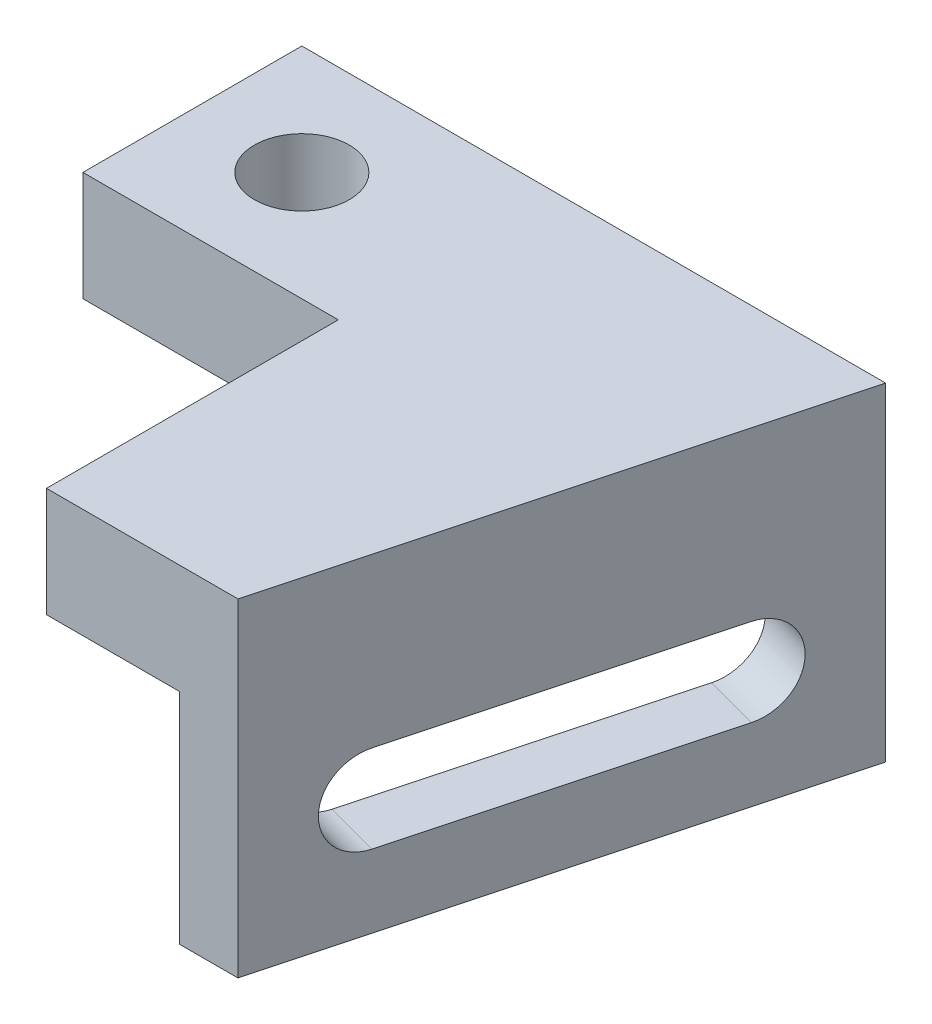
ISO-10303-21;
HEADER;
FILE_DESCRIPTION(('STEP AP214'),'2;1');
FILE_NAME('part.step','',(''),(''),'','','');
FILE_SCHEMA(('AUTOMOTIVE_DESIGN { 1 0 10303 214 1 1 1 1 }'));
ENDSEC;
DATA;
#1=APPLICATION_CONTEXT('core data for automotive mechanical design processes');
#2=APPLICATION_PROTOCOL_DEFINITION('international standard','automotive_design',2000,#1);
#3=PRODUCT_CONTEXT('',#1,'mechanical');
#4=PRODUCT('Part','Part','',(#3));
#5=PRODUCT_RELATED_PRODUCT_CATEGORY('part','',(#4));
#6=PRODUCT_DEFINITION_FORMATION('','',#4);
#7=PRODUCT_DEFINITION_CONTEXT('part definition',#1,'design');
#8=PRODUCT_DEFINITION('design','',#6,#7);
#9=PRODUCT_DEFINITION_SHAPE('','',#8);
#10=(LENGTH_UNIT() NAMED_UNIT(*) SI_UNIT(.MILLI.,.METRE.));
#11=(NAMED_UNIT(*) PLANE_ANGLE_UNIT() SI_UNIT($,.RADIAN.));
#12=(NAMED_UNIT(*) SI_UNIT($,.STERADIAN.) SOLID_ANGLE_UNIT());
#13=UNCERTAINTY_MEASURE_WITH_UNIT(LENGTH_MEASURE(1.E-05),#10,'distance_accuracy_value','');
#14=(GEOMETRIC_REPRESENTATION_CONTEXT(3) GLOBAL_UNCERTAINTY_ASSIGNED_CONTEXT((#13)) GLOBAL_UNIT_ASSIGNED_CONTEXT((#10,
#11,#12)) REPRESENTATION_CONTEXT('',''));
#15=CARTESIAN_POINT('',(0.,0.,0.));
#16=DIRECTION('',(0.,0.,1.));
#17=DIRECTION('',(1.,0.,0.));
#18=AXIS2_PLACEMENT_3D('',#15,#16,#17);
#19=CARTESIAN_POINT('',(0.,0.,0.));
#20=DIRECTION('',(0.,1.,0.));
#21=DIRECTION('',(0.,0.,1.));
#22=AXIS2_PLACEMENT_3D('',#19,#20,#21);
#23=PLANE('',#22);
#24=CARTESIAN_POINT('',(-20.,0.,-15.));
#25=DIRECTION('',(0.,1.,0.));
#26=DIRECTION('',(0.,0.,1.));
#27=AXIS2_PLACEMENT_3D('',#24,#25,#26);
#28=CIRCLE('',#27,6.5);
#29=CARTESIAN_POINT('',(-20.,0.,-8.49999999999999));
#30=VERTEX_POINT('',#29);
#31=EDGE_CURVE('E196',#30,#30,#28,.T.);
#32=ORIENTED_EDGE('',*,*,#31,.T.);
#33=EDGE_LOOP('',(#32));
#34=FACE_BOUND('',#33,.T.);
#35=DIRECTION('',(0.258819045102517,0.,-0.965925826289069));
#36=VECTOR('',#35,1.);
#37=CARTESIAN_POINT('',(18.2435565298217,0.,40.));
#38=LINE('',#37,#36);
#39=CARTESIAN_POINT('',(18.2435565298217,0.,40.));
#40=VERTEX_POINT('',#39);
#41=CARTESIAN_POINT('',(37.,0.,-30.));
#42=VERTEX_POINT('',#41);
#43=EDGE_CURVE('E166',#40,#42,#38,.T.);
#44=ORIENTED_EDGE('',*,*,#43,.F.);
#45=DIRECTION('',(1.,0.,0.));
#46=VECTOR('',#45,1.);
#47=CARTESIAN_POINT('',(26.2435565298217,0.,40.));
#48=LINE('',#47,#46);
#49=CARTESIAN_POINT('',(0.,0.,40.));
#50=VERTEX_POINT('',#49);
#51=EDGE_CURVE('E210',#50,#40,#48,.T.);
#52=ORIENTED_EDGE('',*,*,#51,.F.);
#53=DIRECTION('',(0.,0.,1.));
#54=VECTOR('',#53,1.);
#55=CARTESIAN_POINT('',(0.,0.,0.));
#56=LINE('',#55,#54);
#57=CARTESIAN_POINT('',(0.,0.,0.));
#58=VERTEX_POINT('',#57);
#59=EDGE_CURVE('E234',#58,#50,#56,.T.);
#60=ORIENTED_EDGE('',*,*,#59,.F.);
#61=DIRECTION('',(1.,0.,0.));
#62=VECTOR('',#61,1.);
#63=CARTESIAN_POINT('',(-35.,0.,0.));
#64=LINE('',#63,#62);
#65=CARTESIAN_POINT('',(-35.,0.,0.));
#66=VERTEX_POINT('',#65);
#67=EDGE_CURVE('E231',#66,#58,#64,.T.);
#68=ORIENTED_EDGE('',*,*,#67,.F.);
#69=DIRECTION('',(0.,0.,1.));
#70=VECTOR('',#69,1.);
#71=CARTESIAN_POINT('',(-35.,0.,-30.));
#72=LINE('',#71,#70);
#73=CARTESIAN_POINT('',(-35.,0.,-30.));
#74=VERTEX_POINT('',#73);
#75=EDGE_CURVE('E228',#74,#66,#72,.T.);
#76=ORIENTED_EDGE('',*,*,#75,.F.);
#77=DIRECTION('',(-1.,0.,0.));
#78=VECTOR('',#77,1.);
#79=CARTESIAN_POINT('',(45.,0.,-30.));
#80=LINE('',#79,#78);
#81=EDGE_CURVE('E201',#42,#74,#80,.T.);
#82=ORIENTED_EDGE('',*,*,#81,.F.);
#83=EDGE_LOOP('',(#44,#52,#60,#68,#76,#82));
#84=FACE_BOUND('',#83,.T.);
#85=ADVANCED_FACE('F43',(#34,#84),#23,.F.);
#86=CARTESIAN_POINT('',(0.,15.,0.));
#87=DIRECTION('',(0.,1.,0.));
#88=DIRECTION('',(0.,0.,1.));
#89=AXIS2_PLACEMENT_3D('',#86,#87,#88);
#90=PLANE('',#89);
#91=DIRECTION('',(-1.,0.,0.));
#92=VECTOR('',#91,1.);
#93=CARTESIAN_POINT('',(45.,15.,-30.));
#94=LINE('',#93,#92);
#95=CARTESIAN_POINT('',(45.,15.,-30.));
#96=VERTEX_POINT('',#95);
#97=CARTESIAN_POINT('',(-35.,15.,-30.));
#98=VERTEX_POINT('',#97);
#99=EDGE_CURVE('E205',#96,#98,#94,.T.);
#100=ORIENTED_EDGE('',*,*,#99,.T.);
#101=DIRECTION('',(0.,0.,1.));
#102=VECTOR('',#101,1.);
#103=CARTESIAN_POINT('',(-35.,15.,-30.));
#104=LINE('',#103,#102);
#105=CARTESIAN_POINT('',(-35.,15.,0.));
#106=VERTEX_POINT('',#105);
#107=EDGE_CURVE('E209',#98,#106,#104,.T.);
#108=ORIENTED_EDGE('',*,*,#107,.T.);
#109=DIRECTION('',(1.,0.,0.));
#110=VECTOR('',#109,1.);
#111=CARTESIAN_POINT('',(-35.,15.,0.));
#112=LINE('',#111,#110);
#113=CARTESIAN_POINT('',(0.,15.,0.));
#114=VERTEX_POINT('',#113);
#115=EDGE_CURVE('E213',#106,#114,#112,.T.);
#116=ORIENTED_EDGE('',*,*,#115,.T.);
#117=DIRECTION('',(0.,0.,1.));
#118=VECTOR('',#117,1.);
#119=CARTESIAN_POINT('',(0.,15.,0.));
#120=LINE('',#119,#118);
#121=CARTESIAN_POINT('',(0.,15.,40.));
#122=VERTEX_POINT('',#121);
#123=EDGE_CURVE('E216',#114,#122,#120,.T.);
#124=ORIENTED_EDGE('',*,*,#123,.T.);
#125=DIRECTION('',(1.,0.,0.));
#126=VECTOR('',#125,1.);
#127=CARTESIAN_POINT('',(26.2435565298217,15.,40.));
#128=LINE('',#127,#126);
#129=CARTESIAN_POINT('',(26.2435565298217,15.,40.));
#130=VERTEX_POINT('',#129);
#131=EDGE_CURVE('E219',#122,#130,#128,.T.);
#132=ORIENTED_EDGE('',*,*,#131,.T.);
#133=DIRECTION('',(0.258819045102517,0.,-0.965925826289069));
#134=VECTOR('',#133,1.);
#135=CARTESIAN_POINT('',(45.,15.,-30.));
#136=LINE('',#135,#134);
#137=EDGE_CURVE('E222',#130,#96,#136,.T.);
#138=ORIENTED_EDGE('',*,*,#137,.T.);
#139=EDGE_LOOP('',(#100,#108,#116,#124,#132,#138));
#140=FACE_BOUND('',#139,.T.);
#141=CARTESIAN_POINT('',(-20.,15.,-15.));
#142=DIRECTION('',(0.,1.,0.));
#143=DIRECTION('',(0.,0.,1.));
#144=AXIS2_PLACEMENT_3D('',#141,#142,#143);
#145=CIRCLE('',#144,6.5);
#146=CARTESIAN_POINT('',(-20.,15.,-8.49999999999999));
#147=VERTEX_POINT('',#146);
#148=EDGE_CURVE('E197',#147,#147,#145,.T.);
#149=ORIENTED_EDGE('',*,*,#148,.F.);
#150=EDGE_LOOP('',(#149));
#151=FACE_BOUND('',#150,.T.);
#152=ADVANCED_FACE('F288',(#140,#151),#90,.T.);
#153=CARTESIAN_POINT('',(45.,15.,-30.));
#154=DIRECTION('',(0.,0.,1.));
#155=DIRECTION('',(1.,0.,0.));
#156=AXIS2_PLACEMENT_3D('',#153,#154,#155);
#157=PLANE('',#156);
#158=DIRECTION('',(0.,-1.,0.));
#159=VECTOR('',#158,1.);
#160=CARTESIAN_POINT('',(45.,15.,-30.));
#161=LINE('',#160,#159);
#162=CARTESIAN_POINT('',(45.,-30.,-30.));
#163=VERTEX_POINT('',#162);
#164=EDGE_CURVE('E225',#96,#163,#161,.T.);
#165=ORIENTED_EDGE('',*,*,#164,.T.);
#166=DIRECTION('',(1.,0.,0.));
#167=VECTOR('',#166,1.);
#168=CARTESIAN_POINT('',(37.,-30.,-30.));
#169=LINE('',#168,#167);
#170=CARTESIAN_POINT('',(37.,-30.,-30.));
#171=VERTEX_POINT('',#170);
#172=EDGE_CURVE('E181',#171,#163,#169,.T.);
#173=ORIENTED_EDGE('',*,*,#172,.F.);
#174=DIRECTION('',(0.,1.,0.));
#175=VECTOR('',#174,1.);
#176=CARTESIAN_POINT('',(37.,-30.,-30.));
#177=LINE('',#176,#175);
#178=EDGE_CURVE('E185',#171,#42,#177,.T.);
#179=ORIENTED_EDGE('',*,*,#178,.T.);
#180=ORIENTED_EDGE('',*,*,#81,.T.);
#181=DIRECTION('',(0.,-1.,0.));
#182=VECTOR('',#181,1.);
#183=CARTESIAN_POINT('',(-35.,15.,-30.));
#184=LINE('',#183,#182);
#185=EDGE_CURVE('E257',#98,#74,#184,.T.);
#186=ORIENTED_EDGE('',*,*,#185,.F.);
#187=ORIENTED_EDGE('',*,*,#99,.F.);
#188=EDGE_LOOP('',(#165,#173,#179,#180,#186,#187));
#189=FACE_BOUND('',#188,.T.);
#190=ADVANCED_FACE('F45',(#189),#157,.F.);
#191=CARTESIAN_POINT('',(-35.,15.,-30.));
#192=DIRECTION('',(1.,0.,0.));
#193=DIRECTION('',(0.,0.,-1.));
#194=AXIS2_PLACEMENT_3D('',#191,#192,#193);
#195=PLANE('',#194);
#196=ORIENTED_EDGE('',*,*,#75,.T.);
#197=DIRECTION('',(0.,-1.,0.));
#198=VECTOR('',#197,1.);
#199=CARTESIAN_POINT('',(-35.,15.,0.));
#200=LINE('',#199,#198);
#201=EDGE_CURVE('E253',#106,#66,#200,.T.);
#202=ORIENTED_EDGE('',*,*,#201,.F.);
#203=ORIENTED_EDGE('',*,*,#107,.F.);
#204=ORIENTED_EDGE('',*,*,#185,.T.);
#205=EDGE_LOOP('',(#196,#202,#203,#204));
#206=FACE_BOUND('',#205,.T.);
#207=ADVANCED_FACE('F312',(#206),#195,.F.);
#208=CARTESIAN_POINT('',(-35.,15.,0.));
#209=DIRECTION('',(0.,0.,-1.));
#210=DIRECTION('',(-1.,0.,0.));
#211=AXIS2_PLACEMENT_3D('',#208,#209,#210);
#212=PLANE('',#211);
#213=ORIENTED_EDGE('',*,*,#67,.T.);
#214=DIRECTION('',(0.,-1.,0.));
#215=VECTOR('',#214,1.);
#216=CARTESIAN_POINT('',(0.,15.,0.));
#217=LINE('',#216,#215);
#218=EDGE_CURVE('E249',#114,#58,#217,.T.);
#219=ORIENTED_EDGE('',*,*,#218,.F.);
#220=ORIENTED_EDGE('',*,*,#115,.F.);
#221=ORIENTED_EDGE('',*,*,#201,.T.);
#222=EDGE_LOOP('',(#213,#219,#220,#221));
#223=FACE_BOUND('',#222,.T.);
#224=ADVANCED_FACE('F309',(#223),#212,.F.);
#225=CARTESIAN_POINT('',(0.,15.,0.));
#226=DIRECTION('',(1.,0.,0.));
#227=DIRECTION('',(0.,0.,-1.));
#228=AXIS2_PLACEMENT_3D('',#225,#226,#227);
#229=PLANE('',#228);
#230=ORIENTED_EDGE('',*,*,#59,.T.);
#231=DIRECTION('',(0.,-1.,0.));
#232=VECTOR('',#231,1.);
#233=CARTESIAN_POINT('',(0.,15.,40.));
#234=LINE('',#233,#232);
#235=EDGE_CURVE('E245',#122,#50,#234,.T.);
#236=ORIENTED_EDGE('',*,*,#235,.F.);
#237=ORIENTED_EDGE('',*,*,#123,.F.);
#238=ORIENTED_EDGE('',*,*,#218,.T.);
#239=EDGE_LOOP('',(#230,#236,#237,#238));
#240=FACE_BOUND('',#239,.T.);
#241=ADVANCED_FACE('F305',(#240),#229,.F.);
#242=CARTESIAN_POINT('',(26.2435565298217,15.,40.));
#243=DIRECTION('',(0.,0.,-1.));
#244=DIRECTION('',(-1.,0.,0.));
#245=AXIS2_PLACEMENT_3D('',#242,#243,#244);
#246=PLANE('',#245);
#247=ORIENTED_EDGE('',*,*,#51,.T.);
#248=DIRECTION('',(0.,1.,0.));
#249=VECTOR('',#248,1.);
#250=CARTESIAN_POINT('',(18.2435565298217,-30.,40.));
#251=LINE('',#250,#249);
#252=CARTESIAN_POINT('',(18.2435565298217,-30.,40.));
#253=VERTEX_POINT('',#252);
#254=EDGE_CURVE('E192',#253,#40,#251,.T.);
#255=ORIENTED_EDGE('',*,*,#254,.F.);
#256=DIRECTION('',(-1.,0.,0.));
#257=VECTOR('',#256,1.);
#258=CARTESIAN_POINT('',(26.2435565298217,-30.,40.));
#259=LINE('',#258,#257);
#260=CARTESIAN_POINT('',(26.2435565298217,-30.,40.));
#261=VERTEX_POINT('',#260);
#262=EDGE_CURVE('E175',#261,#253,#259,.T.);
#263=ORIENTED_EDGE('',*,*,#262,.F.);
#264=DIRECTION('',(0.,-1.,0.));
#265=VECTOR('',#264,1.);
#266=CARTESIAN_POINT('',(26.2435565298217,15.,40.));
#267=LINE('',#266,#265);
#268=EDGE_CURVE('E242',#130,#261,#267,.T.);
#269=ORIENTED_EDGE('',*,*,#268,.F.);
#270=ORIENTED_EDGE('',*,*,#131,.F.);
#271=ORIENTED_EDGE('',*,*,#235,.T.);
#272=EDGE_LOOP('',(#247,#255,#263,#269,#270,#271));
#273=FACE_BOUND('',#272,.T.);
#274=ADVANCED_FACE('F302',(#273),#246,.F.);
#275=CARTESIAN_POINT('',(45.,15.,-30.));
#276=DIRECTION('',(-0.965925826289069,0.,-0.258819045102517));
#277=DIRECTION('',(-0.258819045102517,0.,0.965925826289069));
#278=AXIS2_PLACEMENT_3D('',#275,#276,#277);
#279=PLANE('',#278);
#280=CARTESIAN_POINT('',(41.1177143234623,-14.,-15.511112605664));
#281=DIRECTION('',(0.965925826289069,0.,0.258819045102517));
#282=DIRECTION('',(0.258819045102517,0.,-0.965925826289069));
#283=AXIS2_PLACEMENT_3D('',#280,#281,#282);
#284=CIRCLE('',#283,6.);
#285=CARTESIAN_POINT('',(41.1177143234623,-20.,-15.511112605664));
#286=VERTEX_POINT('',#285);
#287=CARTESIAN_POINT('',(41.1177143234623,-8.,-15.511112605664));
#288=VERTEX_POINT('',#287);
#289=EDGE_CURVE('E146',#286,#288,#284,.T.);
#290=ORIENTED_EDGE('',*,*,#289,.F.);
#291=DIRECTION('',(0.258819045102517,0.,-0.965925826289069));
#292=VECTOR('',#291,1.);
#293=CARTESIAN_POINT('',(34.4855715851501,-20.,9.24038105676648));
#294=LINE('',#293,#292);
#295=CARTESIAN_POINT('',(30.1258422063595,-20.,25.511112605664));
#296=VERTEX_POINT('',#295);
#297=EDGE_CURVE('E59',#296,#286,#294,.T.);
#298=ORIENTED_EDGE('',*,*,#297,.F.);
#299=CARTESIAN_POINT('',(30.1258422063595,-14.,25.511112605664));
#300=DIRECTION('',(0.965925826289069,0.,0.258819045102517));
#301=DIRECTION('',(0.258819045102517,0.,-0.965925826289069));
#302=AXIS2_PLACEMENT_3D('',#299,#300,#301);
#303=CIRCLE('',#302,6.);
#304=CARTESIAN_POINT('',(30.1258422063595,-8.,25.511112605664));
#305=VERTEX_POINT('',#304);
#306=EDGE_CURVE('E154',#305,#296,#303,.T.);
#307=ORIENTED_EDGE('',*,*,#306,.F.);
#308=DIRECTION('',(0.258819045102517,0.,-0.965925826289069));
#309=VECTOR('',#308,1.);
#310=CARTESIAN_POINT('',(34.4855715851501,-8.,9.24038105676648));
#311=LINE('',#310,#309);
#312=EDGE_CURVE('E136',#305,#288,#311,.T.);
#313=ORIENTED_EDGE('',*,*,#312,.T.);
#314=EDGE_LOOP('',(#290,#298,#307,#313));
#315=FACE_BOUND('',#314,.T.);
#316=ORIENTED_EDGE('',*,*,#268,.T.);
#317=DIRECTION('',(-0.258819045102517,0.,0.965925826289069));
#318=VECTOR('',#317,1.);
#319=CARTESIAN_POINT('',(45.,-30.,-30.));
#320=LINE('',#319,#318);
#321=EDGE_CURVE('E171',#163,#261,#320,.T.);
#322=ORIENTED_EDGE('',*,*,#321,.F.);
#323=ORIENTED_EDGE('',*,*,#164,.F.);
#324=ORIENTED_EDGE('',*,*,#137,.F.);
#325=EDGE_LOOP('',(#316,#322,#323,#324));
#326=FACE_BOUND('',#325,.T.);
#327=ADVANCED_FACE('F151',(#315,#326),#279,.F.);
#328=CARTESIAN_POINT('',(-20.,15.,-15.));
#329=DIRECTION('',(0.,-1.,0.));
#330=DIRECTION('',(0.,0.,-1.));
#331=AXIS2_PLACEMENT_3D('',#328,#329,#330);
#332=CYLINDRICAL_SURFACE('',#331,6.5);
#333=ORIENTED_EDGE('',*,*,#148,.T.);
#334=EDGE_LOOP('',(#333));
#335=FACE_BOUND('',#334,.T.);
#336=ORIENTED_EDGE('',*,*,#31,.F.);
#337=EDGE_LOOP('',(#336));
#338=FACE_BOUND('',#337,.T.);
#339=ADVANCED_FACE('F301',(#335,#338),#332,.F.);
#340=CARTESIAN_POINT('',(18.2435565298217,-30.,40.));
#341=DIRECTION('',(0.965925826289069,0.,0.258819045102517));
#342=DIRECTION('',(0.258819045102517,0.,-0.965925826289069));
#343=AXIS2_PLACEMENT_3D('',#340,#341,#342);
#344=PLANE('',#343);
#345=CARTESIAN_POINT('',(22.6617405912217,-14.,23.511112605664));
#346=DIRECTION('',(0.965925826289069,0.,0.258819045102517));
#347=DIRECTION('',(0.258819045102517,0.,-0.965925826289069));
#348=AXIS2_PLACEMENT_3D('',#345,#346,#347);
#349=CIRCLE('',#348,6.);
#350=CARTESIAN_POINT('',(22.6617405912217,-8.,23.511112605664));
#351=VERTEX_POINT('',#350);
#352=CARTESIAN_POINT('',(22.6617405912217,-20.,23.511112605664));
#353=VERTEX_POINT('',#352);
#354=EDGE_CURVE('E52',#351,#353,#349,.T.);
#355=ORIENTED_EDGE('',*,*,#354,.T.);
#356=DIRECTION('',(0.258819045102517,0.,-0.965925826289069));
#357=VECTOR('',#356,1.);
#358=CARTESIAN_POINT('',(18.2435565298217,-20.,40.));
#359=LINE('',#358,#357);
#360=CARTESIAN_POINT('',(33.6536127083245,-20.,-17.5111126056639));
#361=VERTEX_POINT('',#360);
#362=EDGE_CURVE('E11',#353,#361,#359,.T.);
#363=ORIENTED_EDGE('',*,*,#362,.T.);
#364=CARTESIAN_POINT('',(33.6536127083245,-14.,-17.5111126056639));
#365=DIRECTION('',(0.965925826289069,0.,0.258819045102517));
#366=DIRECTION('',(0.258819045102517,0.,-0.965925826289069));
#367=AXIS2_PLACEMENT_3D('',#364,#365,#366);
#368=CIRCLE('',#367,6.);
#369=CARTESIAN_POINT('',(33.6536127083245,-8.,-17.5111126056639));
#370=VERTEX_POINT('',#369);
#371=EDGE_CURVE('E261',#361,#370,#368,.T.);
#372=ORIENTED_EDGE('',*,*,#371,.T.);
#373=DIRECTION('',(0.258819045102517,0.,-0.965925826289069));
#374=VECTOR('',#373,1.);
#375=CARTESIAN_POINT('',(18.2435565298217,-8.,40.));
#376=LINE('',#375,#374);
#377=EDGE_CURVE('E139',#351,#370,#376,.T.);
#378=ORIENTED_EDGE('',*,*,#377,.F.);
#379=EDGE_LOOP('',(#355,#363,#372,#378));
#380=FACE_BOUND('',#379,.T.);
#381=ORIENTED_EDGE('',*,*,#43,.T.);
#382=ORIENTED_EDGE('',*,*,#178,.F.);
#383=DIRECTION('',(0.258819045102517,0.,-0.965925826289069));
#384=VECTOR('',#383,1.);
#385=CARTESIAN_POINT('',(18.2435565298217,-30.,40.));
#386=LINE('',#385,#384);
#387=EDGE_CURVE('E178',#253,#171,#386,.T.);
#388=ORIENTED_EDGE('',*,*,#387,.F.);
#389=ORIENTED_EDGE('',*,*,#254,.T.);
#390=EDGE_LOOP('',(#381,#382,#388,#389));
#391=FACE_BOUND('',#390,.T.);
#392=ADVANCED_FACE('F270',(#380,#391),#344,.F.);
#393=CARTESIAN_POINT('',(0.,-30.,0.));
#394=DIRECTION('',(0.,-1.,0.));
#395=DIRECTION('',(0.,0.,-1.));
#396=AXIS2_PLACEMENT_3D('',#393,#394,#395);
#397=PLANE('',#396);
#398=ORIENTED_EDGE('',*,*,#321,.T.);
#399=ORIENTED_EDGE('',*,*,#262,.T.);
#400=ORIENTED_EDGE('',*,*,#387,.T.);
#401=ORIENTED_EDGE('',*,*,#172,.T.);
#402=EDGE_LOOP('',(#398,#399,#400,#401));
#403=FACE_BOUND('',#402,.T.);
#404=ADVANCED_FACE('F277',(#403),#397,.T.);
#405=CARTESIAN_POINT('',(24.8263133222594,-20.,6.65219060574131));
#406=DIRECTION('',(0.,-1.,0.));
#407=DIRECTION('',(0.,0.,-1.));
#408=AXIS2_PLACEMENT_3D('',#405,#406,#407);
#409=PLANE('',#408);
#410=DIRECTION('',(0.965925826289069,0.,0.258819045102517));
#411=VECTOR('',#410,1.);
#412=CARTESIAN_POINT('',(20.4665839434688,-20.,22.9229221546388));
#413=LINE('',#412,#411);
#414=EDGE_CURVE('E163',#353,#296,#413,.T.);
#415=ORIENTED_EDGE('',*,*,#414,.T.);
#416=ORIENTED_EDGE('',*,*,#297,.T.);
#417=DIRECTION('',(0.965925826289069,0.,0.258819045102517));
#418=VECTOR('',#417,1.);
#419=CARTESIAN_POINT('',(31.4584560605716,-20.,-18.0993030566891));
#420=LINE('',#419,#418);
#421=EDGE_CURVE('E143',#361,#286,#420,.T.);
#422=ORIENTED_EDGE('',*,*,#421,.F.);
#423=ORIENTED_EDGE('',*,*,#362,.F.);
#424=EDGE_LOOP('',(#415,#416,#422,#423));
#425=FACE_BOUND('',#424,.T.);
#426=ADVANCED_FACE('F275',(#425),#409,.F.);
#427=CARTESIAN_POINT('',(20.4665839434688,-14.,22.9229221546388));
#428=DIRECTION('',(0.965925826289069,0.,0.258819045102517));
#429=DIRECTION('',(0.258819045102517,0.,-0.965925826289069));
#430=AXIS2_PLACEMENT_3D('',#427,#428,#429);
#431=CYLINDRICAL_SURFACE('',#430,6.);
#432=DIRECTION('',(0.965925826289069,0.,0.258819045102517));
#433=VECTOR('',#432,1.);
#434=CARTESIAN_POINT('',(20.4665839434688,-8.,22.9229221546388));
#435=LINE('',#434,#433);
#436=EDGE_CURVE('E142',#351,#305,#435,.T.);
#437=ORIENTED_EDGE('',*,*,#436,.T.);
#438=ORIENTED_EDGE('',*,*,#306,.T.);
#439=ORIENTED_EDGE('',*,*,#414,.F.);
#440=ORIENTED_EDGE('',*,*,#354,.F.);
#441=EDGE_LOOP('',(#437,#438,#439,#440));
#442=FACE_BOUND('',#441,.T.);
#443=ADVANCED_FACE('F274',(#442),#431,.F.);
#444=CARTESIAN_POINT('',(24.8263133222594,-8.,6.65219060574131));
#445=DIRECTION('',(0.,-1.,0.));
#446=DIRECTION('',(0.,0.,-1.));
#447=AXIS2_PLACEMENT_3D('',#444,#445,#446);
#448=PLANE('',#447);
#449=ORIENTED_EDGE('',*,*,#377,.T.);
#450=DIRECTION('',(0.965925826289069,0.,0.258819045102517));
#451=VECTOR('',#450,1.);
#452=CARTESIAN_POINT('',(31.4584560605716,-8.,-18.0993030566891));
#453=LINE('',#452,#451);
#454=EDGE_CURVE('E67',#370,#288,#453,.T.);
#455=ORIENTED_EDGE('',*,*,#454,.T.);
#456=ORIENTED_EDGE('',*,*,#312,.F.);
#457=ORIENTED_EDGE('',*,*,#436,.F.);
#458=EDGE_LOOP('',(#449,#455,#456,#457));
#459=FACE_BOUND('',#458,.T.);
#460=ADVANCED_FACE('F133',(#459),#448,.T.);
#461=CARTESIAN_POINT('',(31.4584560605716,-14.,-18.0993030566891));
#462=DIRECTION('',(0.965925826289069,0.,0.258819045102517));
#463=DIRECTION('',(0.258819045102517,0.,-0.965925826289069));
#464=AXIS2_PLACEMENT_3D('',#461,#462,#463);
#465=CYLINDRICAL_SURFACE('',#464,6.);
#466=ORIENTED_EDGE('',*,*,#421,.T.);
#467=ORIENTED_EDGE('',*,*,#289,.T.);
#468=ORIENTED_EDGE('',*,*,#454,.F.);
#469=ORIENTED_EDGE('',*,*,#371,.F.);
#470=EDGE_LOOP('',(#466,#467,#468,#469));
#471=FACE_BOUND('',#470,.T.);
#472=ADVANCED_FACE('F147',(#471),#465,.F.);
#473=CLOSED_SHELL('',(#85,#152,#190,#207,#224,#241,#274,#327,#339,#392,#404,#426,#443,#460,#472));
#474=MANIFOLD_SOLID_BREP('B2',#473);
#475=ADVANCED_BREP_SHAPE_REPRESENTATION('',(#18,#474),#14);
#476=SHAPE_DEFINITION_REPRESENTATION(#9,#475);
ENDSEC;
END-ISO-10303-21;
